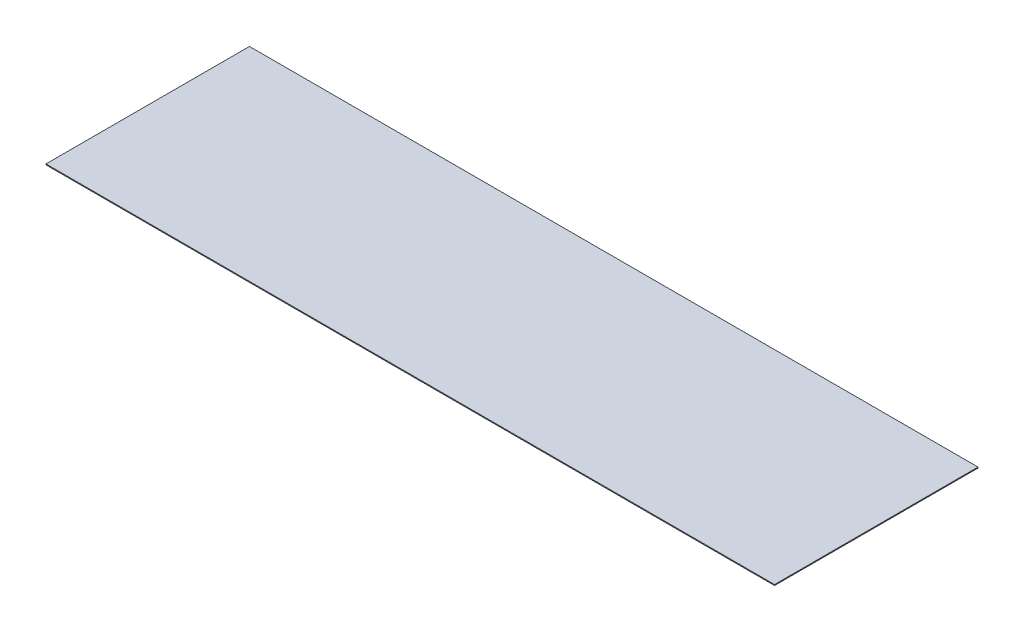
ISO-10303-21;
HEADER;
FILE_DESCRIPTION(('STEP AP214'),'2;1');
FILE_NAME('part.step','',(''),(''),'','','');
FILE_SCHEMA(('AUTOMOTIVE_DESIGN { 1 0 10303 214 1 1 1 1 }'));
ENDSEC;
DATA;
#1=APPLICATION_CONTEXT('core data for automotive mechanical design processes');
#2=APPLICATION_PROTOCOL_DEFINITION('international standard','automotive_design',2000,#1);
#3=PRODUCT_CONTEXT('',#1,'mechanical');
#4=PRODUCT('Part','Part','',(#3));
#5=PRODUCT_RELATED_PRODUCT_CATEGORY('part','',(#4));
#6=PRODUCT_DEFINITION_FORMATION('','',#4);
#7=PRODUCT_DEFINITION_CONTEXT('part definition',#1,'design');
#8=PRODUCT_DEFINITION('design','',#6,#7);
#9=PRODUCT_DEFINITION_SHAPE('','',#8);
#10=(LENGTH_UNIT() NAMED_UNIT(*) SI_UNIT(.MILLI.,.METRE.));
#11=(NAMED_UNIT(*) PLANE_ANGLE_UNIT() SI_UNIT($,.RADIAN.));
#12=(NAMED_UNIT(*) SI_UNIT($,.STERADIAN.) SOLID_ANGLE_UNIT());
#13=UNCERTAINTY_MEASURE_WITH_UNIT(LENGTH_MEASURE(1.E-05),#10,'distance_accuracy_value','');
#14=(GEOMETRIC_REPRESENTATION_CONTEXT(3) GLOBAL_UNCERTAINTY_ASSIGNED_CONTEXT((#13)) GLOBAL_UNIT_ASSIGNED_CONTEXT((#10,
#11,#12)) REPRESENTATION_CONTEXT('',''));
#15=CARTESIAN_POINT('',(0.,0.,0.));
#16=DIRECTION('',(0.,0.,1.));
#17=DIRECTION('',(1.,0.,0.));
#18=AXIS2_PLACEMENT_3D('',#15,#16,#17);
#19=CARTESIAN_POINT('',(23.8922078859806,-199.911233765488,6.91421012168758));
#20=DIRECTION('',(0.,0.999999999708269,2.41549553680284E-05));
#21=DIRECTION('',(0.,-2.41549553680284E-05,0.999999999708269));
#22=AXIS2_PLACEMENT_3D('',#19,#20,#21);
#23=PLANE('',#22);
#24=DIRECTION('',(0.,-2.41549553722581E-05,0.999999999708269));
#25=VECTOR('',#24,1.);
#26=CARTESIAN_POINT('',(-38.4509808997106,-199.910965321633,-4.19919706945121));
#27=LINE('',#26,#25);
#28=CARTESIAN_POINT('',(-38.4509808997106,-199.910965321648,-4.19919646557705));
#29=VERTEX_POINT('',#28);
#30=CARTESIAN_POINT('',(-38.4509808997107,-199.911504943336,18.1408029240315));
#31=VERTEX_POINT('',#30);
#32=EDGE_CURVE('E20',#29,#31,#27,.T.);
#33=ORIENTED_EDGE('',*,*,#32,.F.);
#34=DIRECTION('',(1.,0.,0.));
#35=VECTOR('',#34,1.);
#36=CARTESIAN_POINT('',(1.54901910028942,-199.910965321633,-4.19919706945093));
#37=LINE('',#36,#35);
#38=CARTESIAN_POINT('',(41.5490191002894,-199.910965321633,-4.19919706945065));
#39=VERTEX_POINT('',#38);
#40=EDGE_CURVE('E80',#39,#29,#37,.F.);
#41=ORIENTED_EDGE('',*,*,#40,.F.);
#42=DIRECTION('',(0.,2.41549553722581E-05,-0.999999999708269));
#43=VECTOR('',#42,1.);
#44=CARTESIAN_POINT('',(41.5490191002892,-199.911504943336,18.1408029240321));
#45=LINE('',#44,#43);
#46=CARTESIAN_POINT('',(41.5490191002893,-199.911504943351,18.1408035279058));
#47=VERTEX_POINT('',#46);
#48=EDGE_CURVE('E68',#47,#39,#45,.T.);
#49=ORIENTED_EDGE('',*,*,#48,.F.);
#50=DIRECTION('',(1.,0.,0.));
#51=VECTOR('',#50,1.);
#52=CARTESIAN_POINT('',(1.54901910028926,-199.911504943336,18.1408029240318));
#53=LINE('',#52,#51);
#54=EDGE_CURVE('E55',#31,#47,#53,.T.);
#55=ORIENTED_EDGE('',*,*,#54,.F.);
#56=EDGE_LOOP('',(#33,#41,#49,#55));
#57=FACE_BOUND('',#56,.T.);
#58=ADVANCED_FACE('F17',(#57),#23,.F.);
#59=CARTESIAN_POINT('',(-38.4509808997107,-199.91123223389,6.85080292732516));
#60=DIRECTION('',(-1.,0.,0.));
#61=DIRECTION('',(0.,0.,1.));
#62=AXIS2_PLACEMENT_3D('',#59,#60,#61);
#63=PLANE('',#62);
#64=ORIENTED_EDGE('',*,*,#32,.T.);
#65=DIRECTION('',(0.,-0.999999999708269,-2.41549553680284E-05));
#66=VECTOR('',#65,1.);
#67=CARTESIAN_POINT('',(-38.4509808997107,-199.911504943336,18.1408029240315));
#68=LINE('',#67,#66);
#69=CARTESIAN_POINT('',(-38.4509808997107,-199.811504943337,18.1408041317793));
#70=VERTEX_POINT('',#69);
#71=EDGE_CURVE('E61',#70,#31,#68,.T.);
#72=ORIENTED_EDGE('',*,*,#71,.F.);
#73=DIRECTION('',(0.,-2.41549553680284E-05,0.999999999708269));
#74=VECTOR('',#73,1.);
#75=CARTESIAN_POINT('',(-38.4509808997106,-199.811233765517,6.91421253718312));
#76=LINE('',#75,#74);
#77=CARTESIAN_POINT('',(-38.4509808997106,-199.810965321663,-4.19919465395553));
#78=VERTEX_POINT('',#77);
#79=EDGE_CURVE('E83',#78,#70,#76,.T.);
#80=ORIENTED_EDGE('',*,*,#79,.F.);
#81=DIRECTION('',(0.,0.999999999708269,2.41549553680284E-05));
#82=VECTOR('',#81,1.);
#83=CARTESIAN_POINT('',(-38.4509808997106,-199.910965321633,-4.19919706945121));
#84=LINE('',#83,#82);
#85=EDGE_CURVE('E64',#29,#78,#84,.T.);
#86=ORIENTED_EDGE('',*,*,#85,.F.);
#87=EDGE_LOOP('',(#64,#72,#80,#86));
#88=FACE_BOUND('',#87,.T.);
#89=ADVANCED_FACE('F60',(#88),#63,.T.);
#90=CARTESIAN_POINT('',(1.54901910028926,-199.911504943336,18.1408029240318));
#91=DIRECTION('',(0.,-2.41549553680284E-05,0.999999999708269));
#92=DIRECTION('',(0.,-0.999999999708269,-2.41549553680284E-05));
#93=AXIS2_PLACEMENT_3D('',#90,#91,#92);
#94=PLANE('',#93);
#95=ORIENTED_EDGE('',*,*,#54,.T.);
#96=DIRECTION('',(0.,1.,0.));
#97=VECTOR('',#96,1.);
#98=CARTESIAN_POINT('',(41.5490191002892,-199.91123223389,18.1408053395276));
#99=LINE('',#98,#97);
#100=CARTESIAN_POINT('',(41.5490191002893,-199.811504943366,18.1408053395275));
#101=VERTEX_POINT('',#100);
#102=EDGE_CURVE('E70',#101,#47,#99,.F.);
#103=ORIENTED_EDGE('',*,*,#102,.F.);
#104=DIRECTION('',(1.,0.,0.));
#105=VECTOR('',#104,1.);
#106=CARTESIAN_POINT('',(23.8922078859806,-199.811504943365,18.1408053395271));
#107=LINE('',#106,#105);
#108=EDGE_CURVE('E74',#70,#101,#107,.T.);
#109=ORIENTED_EDGE('',*,*,#108,.F.);
#110=ORIENTED_EDGE('',*,*,#71,.T.);
#111=EDGE_LOOP('',(#95,#103,#109,#110));
#112=FACE_BOUND('',#111,.T.);
#113=ADVANCED_FACE('F72',(#112),#94,.T.);
#114=CARTESIAN_POINT('',(41.5490191002893,-199.91123223389,6.85080292732573));
#115=DIRECTION('',(1.,0.,0.));
#116=DIRECTION('',(0.,0.,-1.));
#117=AXIS2_PLACEMENT_3D('',#114,#115,#116);
#118=PLANE('',#117);
#119=ORIENTED_EDGE('',*,*,#48,.T.);
#120=DIRECTION('',(0.,0.999999999708269,2.41549553680284E-05));
#121=VECTOR('',#120,1.);
#122=CARTESIAN_POINT('',(41.5490191002894,-199.910965321633,-4.19919706945065));
#123=LINE('',#122,#121);
#124=CARTESIAN_POINT('',(41.5490191002894,-199.810965321634,-4.19919586170288));
#125=VERTEX_POINT('',#124);
#126=EDGE_CURVE('E35',#125,#39,#123,.F.);
#127=ORIENTED_EDGE('',*,*,#126,.F.);
#128=DIRECTION('',(0.,-2.41549553680284E-05,0.999999999708269));
#129=VECTOR('',#128,1.);
#130=CARTESIAN_POINT('',(41.5490191002893,-199.811233765517,6.91421253718312));
#131=LINE('',#130,#129);
#132=EDGE_CURVE('E26',#101,#125,#131,.F.);
#133=ORIENTED_EDGE('',*,*,#132,.F.);
#134=ORIENTED_EDGE('',*,*,#102,.T.);
#135=EDGE_LOOP('',(#119,#127,#133,#134));
#136=FACE_BOUND('',#135,.T.);
#137=ADVANCED_FACE('F89',(#136),#118,.T.);
#138=CARTESIAN_POINT('',(1.54901910028942,-199.910965321633,-4.19919706945093));
#139=DIRECTION('',(0.,2.41549553680284E-05,-0.999999999708269));
#140=DIRECTION('',(0.,0.999999999708269,2.41549553680284E-05));
#141=AXIS2_PLACEMENT_3D('',#138,#139,#140);
#142=PLANE('',#141);
#143=ORIENTED_EDGE('',*,*,#40,.T.);
#144=ORIENTED_EDGE('',*,*,#85,.T.);
#145=DIRECTION('',(1.,0.,0.));
#146=VECTOR('',#145,1.);
#147=CARTESIAN_POINT('',(23.8922078859806,-199.810965321662,-4.19919465395511));
#148=LINE('',#147,#146);
#149=EDGE_CURVE('E11',#125,#78,#148,.F.);
#150=ORIENTED_EDGE('',*,*,#149,.F.);
#151=ORIENTED_EDGE('',*,*,#126,.T.);
#152=EDGE_LOOP('',(#143,#144,#150,#151));
#153=FACE_BOUND('',#152,.T.);
#154=ADVANCED_FACE('F91',(#153),#142,.T.);
#155=CARTESIAN_POINT('',(23.8922078859806,-199.811233765517,6.91421253718312));
#156=DIRECTION('',(0.,0.999999999708269,2.41549553680284E-05));
#157=DIRECTION('',(0.,-2.41549553680284E-05,0.999999999708269));
#158=AXIS2_PLACEMENT_3D('',#155,#156,#157);
#159=PLANE('',#158);
#160=ORIENTED_EDGE('',*,*,#132,.T.);
#161=ORIENTED_EDGE('',*,*,#149,.T.);
#162=ORIENTED_EDGE('',*,*,#79,.T.);
#163=ORIENTED_EDGE('',*,*,#108,.T.);
#164=EDGE_LOOP('',(#160,#161,#162,#163));
#165=FACE_BOUND('',#164,.T.);
#166=ADVANCED_FACE('F88',(#165),#159,.T.);
#167=CLOSED_SHELL('',(#58,#89,#113,#137,#154,#166));
#168=MANIFOLD_SOLID_BREP('B1',#167);
#169=ADVANCED_BREP_SHAPE_REPRESENTATION('',(#18,#168),#14);
#170=SHAPE_DEFINITION_REPRESENTATION(#9,#169);
ENDSEC;
END-ISO-10303-21;
